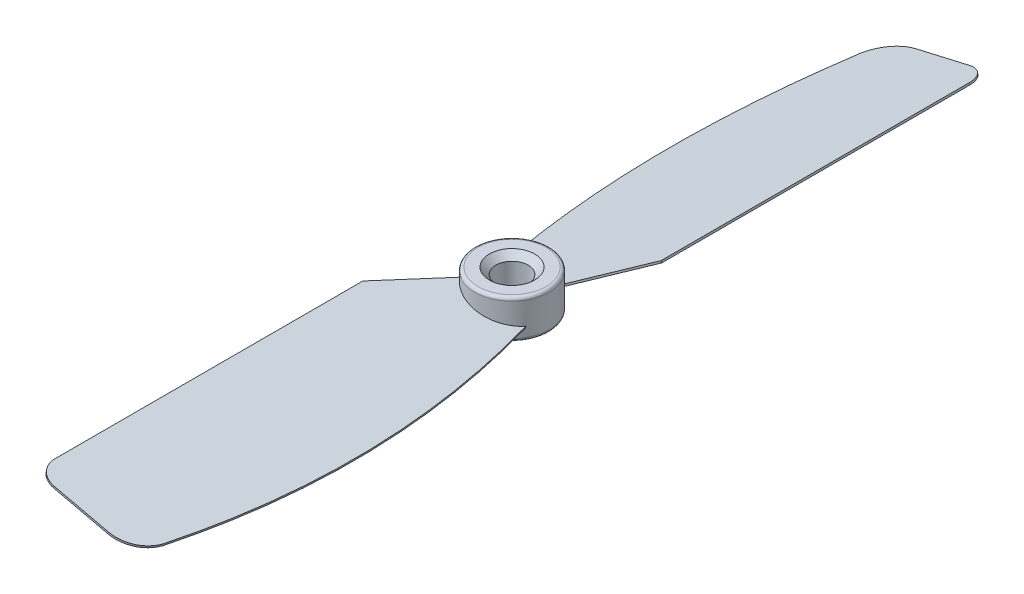
ISO-10303-21;
HEADER;
FILE_DESCRIPTION(('STEP AP214'),'2;1');
FILE_NAME('part.step','',(''),(''),'','','');
FILE_SCHEMA(('AUTOMOTIVE_DESIGN { 1 0 10303 214 1 1 1 1 }'));
ENDSEC;
DATA;
#1=APPLICATION_CONTEXT('core data for automotive mechanical design processes');
#2=APPLICATION_PROTOCOL_DEFINITION('international standard','automotive_design',2000,#1);
#3=PRODUCT_CONTEXT('',#1,'mechanical');
#4=PRODUCT('Part','Part','',(#3));
#5=PRODUCT_RELATED_PRODUCT_CATEGORY('part','',(#4));
#6=PRODUCT_DEFINITION_FORMATION('','',#4);
#7=PRODUCT_DEFINITION_CONTEXT('part definition',#1,'design');
#8=PRODUCT_DEFINITION('design','',#6,#7);
#9=PRODUCT_DEFINITION_SHAPE('','',#8);
#10=(LENGTH_UNIT() NAMED_UNIT(*) SI_UNIT(.MILLI.,.METRE.));
#11=(NAMED_UNIT(*) PLANE_ANGLE_UNIT() SI_UNIT($,.RADIAN.));
#12=(NAMED_UNIT(*) SI_UNIT($,.STERADIAN.) SOLID_ANGLE_UNIT());
#13=UNCERTAINTY_MEASURE_WITH_UNIT(LENGTH_MEASURE(1.E-05),#10,'distance_accuracy_value','');
#14=(GEOMETRIC_REPRESENTATION_CONTEXT(3) GLOBAL_UNCERTAINTY_ASSIGNED_CONTEXT((#13)) GLOBAL_UNIT_ASSIGNED_CONTEXT((#10,
#11,#12)) REPRESENTATION_CONTEXT('',''));
#15=CARTESIAN_POINT('',(0.,0.,0.));
#16=DIRECTION('',(0.,0.,1.));
#17=DIRECTION('',(1.,0.,0.));
#18=AXIS2_PLACEMENT_3D('',#15,#16,#17);
#19=CARTESIAN_POINT('',(0.,3.,0.));
#20=DIRECTION('',(0.,-1.,0.));
#21=DIRECTION('',(0.,0.,-1.));
#22=AXIS2_PLACEMENT_3D('',#19,#20,#21);
#23=CYLINDRICAL_SURFACE('',#22,5.75);
#24=CARTESIAN_POINT('',(0.,-2.5,0.));
#25=DIRECTION('',(0.,1.,0.));
#26=DIRECTION('',(0.,0.,1.));
#27=AXIS2_PLACEMENT_3D('',#24,#25,#26);
#28=CIRCLE('',#27,5.75);
#29=CARTESIAN_POINT('',(0.,-2.5,5.75));
#30=VERTEX_POINT('',#29);
#31=EDGE_CURVE('E412',#30,#30,#28,.T.);
#32=ORIENTED_EDGE('',*,*,#31,.T.);
#33=EDGE_LOOP('',(#32));
#34=FACE_BOUND('',#33,.T.);
#35=CARTESIAN_POINT('',(0.,2.5,0.));
#36=DIRECTION('',(0.,1.,0.));
#37=DIRECTION('',(0.,0.,1.));
#38=AXIS2_PLACEMENT_3D('',#35,#36,#37);
#39=CIRCLE('',#38,5.75);
#40=CARTESIAN_POINT('',(0.,2.5,5.75));
#41=VERTEX_POINT('',#40);
#42=EDGE_CURVE('E417',#41,#41,#39,.F.);
#43=ORIENTED_EDGE('',*,*,#42,.T.);
#44=EDGE_LOOP('',(#43));
#45=FACE_BOUND('',#44,.T.);
#46=CARTESIAN_POINT('',(4.9417821328647,-1.29484591812011,2.93960700626788));
#47=CARTESIAN_POINT('',(4.94963072753522,-1.24621541116266,2.92641441878341));
#48=CARTESIAN_POINT('',(4.95745290419321,-1.19760219934211,2.91314344392264));
#49=CARTESIAN_POINT('',(4.97304442148414,-1.10041036597478,2.88644471944852));
#50=CARTESIAN_POINT('',(4.98081376211709,-1.051831744428,2.87301696983516));
#51=CARTESIAN_POINT('',(4.9885566847375,-1.00327041801812,2.85951083284551));
#52=B_SPLINE_CURVE_WITH_KNOTS('',3,(#46,#47,#48,#49,#50,#51),.UNSPECIFIED.,.F.,.F.,(4,2,4),(0.,
0.152986751924502,0.305973503849005),.UNSPECIFIED.);
#53=CARTESIAN_POINT('',(4.9417821328647,-1.2948459181201,2.93960700626788));
#54=VERTEX_POINT('',#53);
#55=CARTESIAN_POINT('',(4.98855668473749,-1.00327041801825,2.85951083284552));
#56=VERTEX_POINT('',#55);
#57=EDGE_CURVE('E250',#54,#56,#52,.T.);
#58=ORIENTED_EDGE('',*,*,#57,.F.);
#59=CARTESIAN_POINT('',(0.,-0.153945616169008,0.));
#60=DIRECTION('',(-0.224951054343865,-0.974370064785235,0.));
#61=DIRECTION('',(0.974370064785235,-0.224951054343865,0.));
#62=AXIS2_PLACEMENT_3D('',#59,#60,#61);
#63=ELLIPSE('',#62,5.901248619812,5.75);
#64=CARTESIAN_POINT('',(-4.52879961424726,0.891610158742407,3.54294708597149));
#65=VERTEX_POINT('',#64);
#66=EDGE_CURVE('E260',#54,#65,#63,.T.);
#67=ORIENTED_EDGE('',*,*,#66,.T.);
#68=CARTESIAN_POINT('',(0.,10.6574074910067,0.));
#69=DIRECTION('',(-0.82610080536688,0.190720398622423,-0.530267092059743));
#70=DIRECTION('',(-0.160500355097445,-0.981644400762977,-0.103023815034632));
#71=AXIS2_PLACEMENT_3D('',#68,#69,#70);
#72=ELLIPSE('',#71,30.1488463820984,5.75);
#73=CARTESIAN_POINT('',(-4.490682326525,1.19070132181337,3.59113801492452));
#74=VERTEX_POINT('',#73);
#75=EDGE_CURVE('E363',#65,#74,#72,.T.);
#76=ORIENTED_EDGE('',*,*,#75,.T.);
#77=CARTESIAN_POINT('',(0.,0.153945616169009,0.));
#78=DIRECTION('',(-0.224951054343865,-0.974370064785235,0.));
#79=DIRECTION('',(0.974370064785235,-0.224951054343865,0.));
#80=AXIS2_PLACEMENT_3D('',#77,#78,#79);
#81=ELLIPSE('',#80,5.901248619812,5.75);
#82=CARTESIAN_POINT('',(4.18430648262315,-0.812077652589167,3.94386602960455));
#83=VERTEX_POINT('',#82);
#84=EDGE_CURVE('E361',#83,#74,#81,.T.);
#85=ORIENTED_EDGE('',*,*,#84,.F.);
#86=CARTESIAN_POINT('',(3.16767160626644,3.,-4.79878699202761));
#87=CARTESIAN_POINT('',(3.21135823881869,2.86347763932167,-4.76990080416653));
#88=CARTESIAN_POINT('',(3.25831072799962,2.72851525371669,-4.73809518863794));
#89=CARTESIAN_POINT('',(3.35878276436216,2.46270418555435,-4.66743904078927));
#90=CARTESIAN_POINT('',(3.41231267677481,2.33186241493979,-4.62857734168117));
#91=CARTESIAN_POINT('',(3.52582268552945,2.07575808035222,-4.54269725417273));
#92=CARTESIAN_POINT('',(3.58580136458445,1.95049429899198,-4.49568065663974));
#93=CARTESIAN_POINT('',(3.71152105949493,1.70690799351835,-4.39246231239903));
#94=CARTESIAN_POINT('',(3.77725867580308,1.58858144225546,-4.33626596785345));
#95=CARTESIAN_POINT('',(3.91399246351864,1.35883994756971,-4.21327533406064));
#96=CARTESIAN_POINT('',(3.98503443812991,1.24750546292712,-4.14638118579225));
#97=CARTESIAN_POINT('',(4.13002060053663,1.03392989063531,-4.00198562796744));
#98=CARTESIAN_POINT('',(4.20396536707744,0.931690629757777,-3.92448209542118));
#99=CARTESIAN_POINT('',(4.35245136205382,0.737010280755849,-3.75911945986299));
#100=CARTESIAN_POINT('',(4.42699074177325,0.644546351235127,-3.67128555831832));
#101=CARTESIAN_POINT('',(4.57466300030841,0.469127473536056,-3.48554543816858));
#102=CARTESIAN_POINT('',(4.64779597615056,0.386171867415056,-3.38763991737491));
#103=CARTESIAN_POINT('',(4.78298287441558,0.237776232246507,-3.19343798779635));
#104=CARTESIAN_POINT('',(4.8453858444472,0.171411752154987,-3.09808655755151));
#105=CARTESIAN_POINT('',(4.96615503618029,0.0455617023530034,-2.90055208369523));
#106=CARTESIAN_POINT('',(5.02452160039601,-0.0139244513150001,-2.79836962119025));
#107=CARTESIAN_POINT('',(5.13618704477087,-0.12656545453546,-2.5877235693401));
#108=CARTESIAN_POINT('',(5.1894791665124,-0.17971188365455,-2.4792519045131));
#109=CARTESIAN_POINT('',(5.28998148598342,-0.280067198058982,-2.25687567329933));
#110=CARTESIAN_POINT('',(5.33719121185681,-0.327275622682971,-2.14297068634797));
#111=CARTESIAN_POINT('',(5.42836452978435,-0.419870560797796,-1.90090291904142));
#112=CARTESIAN_POINT('',(5.47174064126546,-0.464786888264962,-1.7723384617502));
#113=CARTESIAN_POINT('',(5.54968087363048,-0.548709993894481,-1.51068876801557));
#114=CARTESIAN_POINT('',(5.58424463158523,-0.587716528640298,-1.37760334563585));
#115=CARTESIAN_POINT('',(5.64394293157941,-0.660252373771145,-1.10791552420304));
#116=CARTESIAN_POINT('',(5.66908015778435,-0.693783241791831,-0.971314138163177));
#117=CARTESIAN_POINT('',(5.7094882701705,-0.755758856865341,-0.695473351138391));
#118=CARTESIAN_POINT('',(5.72475563606061,-0.784201786585769,-0.556233027127374));
#119=CARTESIAN_POINT('',(5.74560241971585,-0.837612950445586,-0.268956248094331));
#120=CARTESIAN_POINT('',(5.75064705194649,-0.86232943371669,-0.120833831344237));
#121=CARTESIAN_POINT('',(5.74921977087372,-0.906720010625236,0.176178786841892));
#122=CARTESIAN_POINT('',(5.74274245162587,-0.926391732373468,0.325069315982901));
#123=CARTESIAN_POINT('',(5.71815480587072,-0.960853895575036,0.622471742080835));
#124=CARTESIAN_POINT('',(5.70004323044812,-0.975643812717848,0.770983596669189));
#125=CARTESIAN_POINT('',(5.65221618033073,-1.00042376620019,1.06646198746962));
#126=CARTESIAN_POINT('',(5.62250604404078,-1.01041600602858,1.21342920271255));
#127=CARTESIAN_POINT('',(5.55145844568355,-1.02564659029179,1.50548934051953));
#128=CARTESIAN_POINT('',(5.51006868723436,-1.03086309459926,1.6505706904485));
#129=CARTESIAN_POINT('',(5.41599536510503,-1.03636242242856,1.9370642306828));
#130=CARTESIAN_POINT('',(5.36331588532275,-1.03664702695634,2.07847772710094));
#131=CARTESIAN_POINT('',(5.24698659120449,-1.03206279048437,2.35677664802207));
#132=CARTESIAN_POINT('',(5.18332747467966,-1.0271895615247,2.49365811471466));
#133=CARTESIAN_POINT('',(5.04558750828644,-1.0119058020542,2.76174846056919));
#134=CARTESIAN_POINT('',(4.97150719016936,-1.00149555399949,2.89295762871903));
#135=CARTESIAN_POINT('',(4.81482569395801,-0.97476777038085,3.14671903456508));
#136=CARTESIAN_POINT('',(4.73237554141263,-0.958544963332007,3.26937441961475));
#137=CARTESIAN_POINT('',(4.55885183353354,-0.919359902426758,3.50728359663349));
#138=CARTESIAN_POINT('',(4.46777922987299,-0.896398391745371,3.62253820308679));
#139=CARTESIAN_POINT('',(4.2782008492359,-0.842610427821037,3.84457854183849));
#140=CARTESIAN_POINT('',(4.17970394427395,-0.811793260322456,3.95137407912479));
#141=CARTESIAN_POINT('',(3.97667295590769,-0.740684653806231,4.15563004786195));
#142=CARTESIAN_POINT('',(3.87214267728593,-0.700399137545731,4.2530962616863));
#143=CARTESIAN_POINT('',(3.70067032253633,-0.626175848791668,4.40169944136899));
#144=CARTESIAN_POINT('',(3.63495093630015,-0.595880199382195,4.45609166326384));
#145=CARTESIAN_POINT('',(3.50271116087788,-0.530373645404925,4.5607691980547));
#146=CARTESIAN_POINT('',(3.43619104019514,-0.495164348722405,4.6110558459137));
#147=CARTESIAN_POINT('',(3.3032630931747,-0.419268685131995,4.70719281051927));
#148=CARTESIAN_POINT('',(3.23685528166762,-0.378592353905034,4.75305099746902));
#149=CARTESIAN_POINT('',(3.10506551106653,-0.291164460654061,4.8401778986794));
#150=CARTESIAN_POINT('',(3.03968338231666,-0.244413915484126,4.88144737897154));
#151=CARTESIAN_POINT('',(2.86605785764219,-0.109258322094918,4.98642514684996));
#152=CARTESIAN_POINT('',(2.7598125208222,-0.0145851517664133,5.04564491025323));
#153=CARTESIAN_POINT('',(2.56014858894786,0.193726514284796,5.1498449450528));
#154=CARTESIAN_POINT('',(2.46670376400153,0.307325137016162,5.19485458960251));
#155=CARTESIAN_POINT('',(2.29716490186737,0.549551252564028,5.27202434677673));
#156=CARTESIAN_POINT('',(2.22097432448156,0.678088711318857,5.3042567520434));
#157=CARTESIAN_POINT('',(2.11930159246336,0.879102028300293,5.34531430199157));
#158=CARTESIAN_POINT('',(2.08741443388145,0.947755641417451,5.35781897765336));
#159=CARTESIAN_POINT('',(2.02769130852339,1.08714496751949,5.3807053500982));
#160=CARTESIAN_POINT('',(1.99985497879419,1.15788049328201,5.39108723711629));
#161=CARTESIAN_POINT('',(1.92204804698519,1.37218880627227,5.41953166652336));
#162=CARTESIAN_POINT('',(1.8776460898563,1.51813612836278,5.43494502822963));
#163=CARTESIAN_POINT('',(1.80065963086418,1.81370800548155,5.46092881835123));
#164=CARTESIAN_POINT('',(1.76810074726821,1.96333979331345,5.47148876096717));
#165=CARTESIAN_POINT('',(1.71286660847994,2.26070780674924,5.48902524305081));
#166=CARTESIAN_POINT('',(1.68996510914258,2.40839823738088,5.49608458360291));
#167=CARTESIAN_POINT('',(1.6607340621867,2.6302730938577,5.50495772524652));
#168=CARTESIAN_POINT('',(1.65185932036268,2.70410804427553,5.50762504304568));
#169=CARTESIAN_POINT('',(1.63559702588113,2.85194037529872,5.51247617155887));
#170=CARTESIAN_POINT('',(1.62820912076886,2.92593771319571,5.5146600968734));
#171=CARTESIAN_POINT('',(1.6214686491818,2.99999999996983,5.51664204201438));
#172=B_SPLINE_CURVE_WITH_KNOTS('',3,(#86,#87,#88,#89,#90,#91,#92,#93,#94,#95,#96,#97,#98,#99,
#100,#101,#102,#103,#104,#105,#106,#107,#108,#109,#110,#111,#112,#113,#114,#115,#116,#117,#118,
#119,#120,#121,#122,#123,#124,#125,#126,#127,#128,#129,#130,#131,#132,#133,#134,#135,#136,#137,
#138,#139,#140,#141,#142,#143,#144,#145,#146,#147,#148,#149,#150,#151,#152,#153,#154,#155,#156,
#157,#158,#159,#160,#161,#162,#163,#164,#165,#166,#167,#168,#169,#170,#171),.UNSPECIFIED.,.F.,
.F.,(4,2,2,2,2,2,2,2,2,2,2,2,2,2,2,2,2,2,2,2,2,2,2,2,2,2,2,2,2,2,2,2,2,2,2,2,2,2,2,2,2,2,4),(0.,
0.43874216926316,0.878184831150759,1.31753111055053,1.7566197656927,2.20007610467262,
2.64362131151342,3.086106075379,3.52856020234178,3.92375798613212,4.31892219366864,
4.71460554898124,5.11031958189865,5.53862093954271,5.96693993355944,6.39513687275773,
6.82348645316722,7.27371955937333,7.72416396460999,8.17465673228089,8.62494239815624,
9.07727714625673,9.52944854398299,9.9820049300964,10.434538232478,10.8800090097613,
11.3254306769423,11.7703282573157,12.2149482771483,12.4863383067682,12.7576397371736,
13.028449781144,13.2992145484171,13.7593125354183,14.2184531497409,14.6749575788319,
14.904994111258,15.1350100197731,15.5941238149781,16.0542249147554,16.5028511936243,
16.726081778648,16.9492593843557),.UNSPECIFIED.);
#173=EDGE_CURVE('E274',#56,#83,#172,.T.);
#174=ORIENTED_EDGE('',*,*,#173,.F.);
#175=EDGE_LOOP('',(#58,#67,#76,#85,#174));
#176=FACE_BOUND('',#175,.T.);
#177=CARTESIAN_POINT('',(-4.9417821328647,-1.29484591812011,-2.93960700626788));
#178=CARTESIAN_POINT('',(-4.94963072753522,-1.24621541116266,-2.92641441878341));
#179=CARTESIAN_POINT('',(-4.95745290419321,-1.19760219934211,-2.91314344392264));
#180=CARTESIAN_POINT('',(-4.97304442148414,-1.10041036597478,-2.88644471944852));
#181=CARTESIAN_POINT('',(-4.98081376211709,-1.051831744428,-2.87301696983516));
#182=CARTESIAN_POINT('',(-4.9885566847375,-1.00327041801812,-2.85951083284551));
#183=B_SPLINE_CURVE_WITH_KNOTS('',3,(#177,#178,#179,#180,#181,#182),.UNSPECIFIED.,.F.,.F.,(4,2,
4),(0.,0.152986751924502,0.305973503849005),.UNSPECIFIED.);
#184=CARTESIAN_POINT('',(-4.9417821328647,-1.2948459181201,-2.93960700626788));
#185=VERTEX_POINT('',#184);
#186=CARTESIAN_POINT('',(-4.98855668473749,-1.00327041801825,-2.85951083284552));
#187=VERTEX_POINT('',#186);
#188=EDGE_CURVE('E60',#185,#187,#183,.T.);
#189=ORIENTED_EDGE('',*,*,#188,.F.);
#190=CARTESIAN_POINT('',(0.,-0.153945616169008,0.));
#191=DIRECTION('',(0.224951054343865,-0.974370064785235,0.));
#192=DIRECTION('',(-0.974370064785235,-0.224951054343865,0.));
#193=AXIS2_PLACEMENT_3D('',#190,#191,#192);
#194=ELLIPSE('',#193,5.901248619812,5.75);
#195=CARTESIAN_POINT('',(4.52879961424726,0.891610158742407,-3.54294708597149));
#196=VERTEX_POINT('',#195);
#197=EDGE_CURVE('E163',#185,#196,#194,.T.);
#198=ORIENTED_EDGE('',*,*,#197,.T.);
#199=CARTESIAN_POINT('',(0.,10.6574074910067,0.));
#200=DIRECTION('',(0.82610080536688,0.190720398622423,0.530267092059743));
#201=DIRECTION('',(0.160500355097445,-0.981644400762977,0.103023815034632));
#202=AXIS2_PLACEMENT_3D('',#199,#200,#201);
#203=ELLIPSE('',#202,30.1488463820984,5.75);
#204=CARTESIAN_POINT('',(4.490682326525,1.19070132181337,-3.59113801492452));
#205=VERTEX_POINT('',#204);
#206=EDGE_CURVE('E289',#196,#205,#203,.T.);
#207=ORIENTED_EDGE('',*,*,#206,.T.);
#208=CARTESIAN_POINT('',(0.,0.153945616169009,0.));
#209=DIRECTION('',(0.224951054343865,-0.974370064785235,0.));
#210=DIRECTION('',(-0.974370064785235,-0.224951054343865,0.));
#211=AXIS2_PLACEMENT_3D('',#208,#209,#210);
#212=ELLIPSE('',#211,5.901248619812,5.75);
#213=CARTESIAN_POINT('',(-4.18430648262315,-0.812077652589167,-3.94386602960455));
#214=VERTEX_POINT('',#213);
#215=EDGE_CURVE('E259',#214,#205,#212,.T.);
#216=ORIENTED_EDGE('',*,*,#215,.F.);
#217=CARTESIAN_POINT('',(-3.16767160626644,3.,4.79878699202761));
#218=CARTESIAN_POINT('',(-3.21135823881869,2.86347763932167,4.76990080416653));
#219=CARTESIAN_POINT('',(-3.25831072799962,2.72851525371669,4.73809518863794));
#220=CARTESIAN_POINT('',(-3.35878276436216,2.46270418555435,4.66743904078927));
#221=CARTESIAN_POINT('',(-3.41231267677481,2.33186241493979,4.62857734168117));
#222=CARTESIAN_POINT('',(-3.52582268552945,2.07575808035222,4.54269725417273));
#223=CARTESIAN_POINT('',(-3.58580136458445,1.95049429899198,4.49568065663974));
#224=CARTESIAN_POINT('',(-3.71152105949493,1.70690799351835,4.39246231239903));
#225=CARTESIAN_POINT('',(-3.77725867580308,1.58858144225546,4.33626596785345));
#226=CARTESIAN_POINT('',(-3.91399246351864,1.35883994756971,4.21327533406064));
#227=CARTESIAN_POINT('',(-3.98503443812991,1.24750546292712,4.14638118579225));
#228=CARTESIAN_POINT('',(-4.13002060053663,1.03392989063531,4.00198562796744));
#229=CARTESIAN_POINT('',(-4.20396536707744,0.931690629757777,3.92448209542118));
#230=CARTESIAN_POINT('',(-4.35245136205382,0.737010280755849,3.75911945986299));
#231=CARTESIAN_POINT('',(-4.42699074177325,0.644546351235127,3.67128555831832));
#232=CARTESIAN_POINT('',(-4.57466300030841,0.469127473536056,3.48554543816858));
#233=CARTESIAN_POINT('',(-4.64779597615056,0.386171867415056,3.38763991737491));
#234=CARTESIAN_POINT('',(-4.78298287441558,0.237776232246507,3.19343798779635));
#235=CARTESIAN_POINT('',(-4.8453858444472,0.171411752154987,3.09808655755151));
#236=CARTESIAN_POINT('',(-4.96615503618029,0.0455617023530034,2.90055208369523));
#237=CARTESIAN_POINT('',(-5.02452160039601,-0.0139244513150001,2.79836962119025));
#238=CARTESIAN_POINT('',(-5.13618704477087,-0.12656545453546,2.5877235693401));
#239=CARTESIAN_POINT('',(-5.1894791665124,-0.17971188365455,2.4792519045131));
#240=CARTESIAN_POINT('',(-5.28998148598342,-0.280067198058982,2.25687567329933));
#241=CARTESIAN_POINT('',(-5.33719121185681,-0.327275622682971,2.14297068634797));
#242=CARTESIAN_POINT('',(-5.42836452978435,-0.419870560797796,1.90090291904142));
#243=CARTESIAN_POINT('',(-5.47174064126546,-0.464786888264962,1.7723384617502));
#244=CARTESIAN_POINT('',(-5.54968087363048,-0.548709993894481,1.51068876801557));
#245=CARTESIAN_POINT('',(-5.58424463158523,-0.587716528640297,1.37760334563585));
#246=CARTESIAN_POINT('',(-5.64394293157941,-0.660252373771146,1.10791552420304));
#247=CARTESIAN_POINT('',(-5.66908015778435,-0.693783241791835,0.971314138163178));
#248=CARTESIAN_POINT('',(-5.7094882701705,-0.755758856865344,0.695473351138392));
#249=CARTESIAN_POINT('',(-5.72475563606061,-0.78420178658577,0.556233027127374));
#250=CARTESIAN_POINT('',(-5.74560241971585,-0.837612950445585,0.268956248094331));
#251=CARTESIAN_POINT('',(-5.75064705194649,-0.862329433716692,0.120833831344238));
#252=CARTESIAN_POINT('',(-5.74921977087372,-0.906720010625238,-0.176178786841891));
#253=CARTESIAN_POINT('',(-5.74274245162587,-0.926391732373469,-0.325069315982901));
#254=CARTESIAN_POINT('',(-5.71815480587072,-0.960853895575036,-0.622471742080835));
#255=CARTESIAN_POINT('',(-5.70004323044812,-0.975643812717849,-0.770983596669189));
#256=CARTESIAN_POINT('',(-5.65221618033073,-1.00042376620019,-1.06646198746963));
#257=CARTESIAN_POINT('',(-5.62250604404078,-1.01041600602858,-1.21342920271255));
#258=CARTESIAN_POINT('',(-5.55145844568355,-1.02564659029179,-1.50548934051953));
#259=CARTESIAN_POINT('',(-5.51006868723436,-1.03086309459926,-1.6505706904485));
#260=CARTESIAN_POINT('',(-5.41599536510503,-1.03636242242856,-1.9370642306828));
#261=CARTESIAN_POINT('',(-5.36331588532275,-1.03664702695634,-2.07847772710094));
#262=CARTESIAN_POINT('',(-5.24698659120449,-1.03206279048437,-2.35677664802207));
#263=CARTESIAN_POINT('',(-5.18332747467966,-1.0271895615247,-2.49365811471466));
#264=CARTESIAN_POINT('',(-5.04558750828644,-1.0119058020542,-2.76174846056919));
#265=CARTESIAN_POINT('',(-4.97150719016936,-1.00149555399949,-2.89295762871903));
#266=CARTESIAN_POINT('',(-4.81482569395801,-0.97476777038085,-3.14671903456508));
#267=CARTESIAN_POINT('',(-4.73237554141263,-0.958544963332007,-3.26937441961475));
#268=CARTESIAN_POINT('',(-4.55885183353354,-0.919359902426758,-3.50728359663349));
#269=CARTESIAN_POINT('',(-4.46777922987299,-0.896398391745371,-3.62253820308679));
#270=CARTESIAN_POINT('',(-4.2782008492359,-0.842610427821037,-3.84457854183849));
#271=CARTESIAN_POINT('',(-4.17970394427395,-0.811793260322456,-3.95137407912479));
#272=CARTESIAN_POINT('',(-3.97667295590769,-0.740684653806231,-4.15563004786195));
#273=CARTESIAN_POINT('',(-3.87214267728593,-0.700399137545731,-4.2530962616863));
#274=CARTESIAN_POINT('',(-3.70067032253633,-0.626175848791668,-4.40169944136899));
#275=CARTESIAN_POINT('',(-3.63495093630015,-0.595880199382195,-4.45609166326384));
#276=CARTESIAN_POINT('',(-3.50271116087788,-0.530373645404925,-4.5607691980547));
#277=CARTESIAN_POINT('',(-3.43619104019514,-0.495164348722405,-4.6110558459137));
#278=CARTESIAN_POINT('',(-3.3032630931747,-0.419268685131995,-4.70719281051927));
#279=CARTESIAN_POINT('',(-3.23685528166762,-0.378592353905034,-4.75305099746902));
#280=CARTESIAN_POINT('',(-3.10506551106653,-0.291164460654061,-4.8401778986794));
#281=CARTESIAN_POINT('',(-3.03968338231666,-0.244413915484126,-4.88144737897154));
#282=CARTESIAN_POINT('',(-2.86605785764219,-0.109258322094918,-4.98642514684996));
#283=CARTESIAN_POINT('',(-2.7598125208222,-0.0145851517664133,-5.04564491025323));
#284=CARTESIAN_POINT('',(-2.56014858894786,0.193726514284796,-5.1498449450528));
#285=CARTESIAN_POINT('',(-2.46670376400153,0.307325137016162,-5.19485458960251));
#286=CARTESIAN_POINT('',(-2.29716490186737,0.549551252564028,-5.27202434677673));
#287=CARTESIAN_POINT('',(-2.22097432448156,0.678088711318857,-5.3042567520434));
#288=CARTESIAN_POINT('',(-2.11930159246336,0.879102028300293,-5.34531430199157));
#289=CARTESIAN_POINT('',(-2.08741443388145,0.947755641417451,-5.35781897765336));
#290=CARTESIAN_POINT('',(-2.02769130852339,1.08714496751949,-5.3807053500982));
#291=CARTESIAN_POINT('',(-1.99985497879419,1.15788049328201,-5.39108723711629));
#292=CARTESIAN_POINT('',(-1.92204804698519,1.37218880627227,-5.41953166652336));
#293=CARTESIAN_POINT('',(-1.8776460898563,1.51813612836278,-5.43494502822963));
#294=CARTESIAN_POINT('',(-1.80065963086418,1.81370800548155,-5.46092881835123));
#295=CARTESIAN_POINT('',(-1.7681007472682,1.96333979331344,-5.47148876096717));
#296=CARTESIAN_POINT('',(-1.71286660847994,2.26070780674924,-5.48902524305081));
#297=CARTESIAN_POINT('',(-1.68996510914259,2.40839823738088,-5.49608458360291));
#298=CARTESIAN_POINT('',(-1.6607340621867,2.6302730938577,-5.50495772524652));
#299=CARTESIAN_POINT('',(-1.65185932036268,2.70410804427553,-5.50762504304568));
#300=CARTESIAN_POINT('',(-1.63559702588112,2.85194037529872,-5.51247617155887));
#301=CARTESIAN_POINT('',(-1.62820912076886,2.92593771319571,-5.5146600968734));
#302=CARTESIAN_POINT('',(-1.6214686491818,2.99999999996983,-5.51664204201438));
#303=B_SPLINE_CURVE_WITH_KNOTS('',3,(#217,#218,#219,#220,#221,#222,#223,#224,#225,#226,#227,
#228,#229,#230,#231,#232,#233,#234,#235,#236,#237,#238,#239,#240,#241,#242,#243,#244,#245,#246,
#247,#248,#249,#250,#251,#252,#253,#254,#255,#256,#257,#258,#259,#260,#261,#262,#263,#264,#265,
#266,#267,#268,#269,#270,#271,#272,#273,#274,#275,#276,#277,#278,#279,#280,#281,#282,#283,#284,
#285,#286,#287,#288,#289,#290,#291,#292,#293,#294,#295,#296,#297,#298,#299,#300,#301,#302),
.UNSPECIFIED.,.F.,.F.,(4,2,2,2,2,2,2,2,2,2,2,2,2,2,2,2,2,2,2,2,2,2,2,2,2,2,2,2,2,2,2,2,2,2,2,2,
2,2,2,2,2,2,4),(0.,0.43874216926316,0.878184831150759,1.31753111055053,1.7566197656927,
2.20007610467262,2.64362131151342,3.086106075379,3.52856020234178,3.92375798613212,
4.31892219366864,4.71460554898124,5.11031958189865,5.53862093954271,5.96693993355944,
6.39513687275774,6.82348645316722,7.27371955937333,7.72416396460999,8.17465673228089,
8.62494239815624,9.07727714625673,9.52944854398299,9.9820049300964,10.434538232478,
10.8800090097614,11.3254306769423,11.7703282573157,12.2149482771483,12.4863383067682,
12.7576397371736,13.028449781144,13.2992145484171,13.7593125354183,14.2184531497409,
14.6749575788319,14.904994111258,15.1350100197731,15.5941238149781,16.0542249147554,
16.5028511936243,16.726081778648,16.9492593843557),.UNSPECIFIED.);
#304=EDGE_CURVE('E65',#187,#214,#303,.T.);
#305=ORIENTED_EDGE('',*,*,#304,.F.);
#306=EDGE_LOOP('',(#189,#198,#207,#216,#305));
#307=FACE_BOUND('',#306,.T.);
#308=ADVANCED_FACE('F44',(#34,#45,#176,#307),#23,.T.);
#309=CARTESIAN_POINT('',(0.,3.,0.));
#310=DIRECTION('',(0.,1.,0.));
#311=DIRECTION('',(0.,0.,1.));
#312=AXIS2_PLACEMENT_3D('',#309,#310,#311);
#313=PLANE('',#312);
#314=CARTESIAN_POINT('',(0.,3.,0.));
#315=DIRECTION('',(0.,1.,0.));
#316=DIRECTION('',(0.,0.,1.));
#317=AXIS2_PLACEMENT_3D('',#314,#315,#316);
#318=CIRCLE('',#317,3.5);
#319=CARTESIAN_POINT('',(0.,3.,3.5));
#320=VERTEX_POINT('',#319);
#321=EDGE_CURVE('E13',#320,#320,#318,.F.);
#322=ORIENTED_EDGE('',*,*,#321,.T.);
#323=EDGE_LOOP('',(#322));
#324=FACE_BOUND('',#323,.T.);
#325=CARTESIAN_POINT('',(0.,3.,0.));
#326=DIRECTION('',(0.,1.,0.));
#327=DIRECTION('',(0.,0.,1.));
#328=AXIS2_PLACEMENT_3D('',#325,#326,#327);
#329=CIRCLE('',#328,5.25);
#330=CARTESIAN_POINT('',(0.,3.,5.25));
#331=VERTEX_POINT('',#330);
#332=EDGE_CURVE('E411',#331,#331,#329,.T.);
#333=ORIENTED_EDGE('',*,*,#332,.T.);
#334=EDGE_LOOP('',(#333));
#335=FACE_BOUND('',#334,.T.);
#336=ADVANCED_FACE('F267',(#324,#335),#313,.T.);
#337=CARTESIAN_POINT('',(0.,-3.,0.));
#338=DIRECTION('',(0.,1.,0.));
#339=DIRECTION('',(0.,0.,1.));
#340=AXIS2_PLACEMENT_3D('',#337,#338,#339);
#341=PLANE('',#340);
#342=CARTESIAN_POINT('',(0.,-3.,0.));
#343=DIRECTION('',(0.,1.,0.));
#344=DIRECTION('',(0.,0.,1.));
#345=AXIS2_PLACEMENT_3D('',#342,#343,#344);
#346=CIRCLE('',#345,3.5);
#347=CARTESIAN_POINT('',(0.,-3.,3.5));
#348=VERTEX_POINT('',#347);
#349=EDGE_CURVE('E406',#348,#348,#346,.T.);
#350=ORIENTED_EDGE('',*,*,#349,.T.);
#351=EDGE_LOOP('',(#350));
#352=FACE_BOUND('',#351,.T.);
#353=CARTESIAN_POINT('',(0.,-3.,0.));
#354=DIRECTION('',(0.,1.,0.));
#355=DIRECTION('',(0.,0.,1.));
#356=AXIS2_PLACEMENT_3D('',#353,#354,#355);
#357=CIRCLE('',#356,5.25);
#358=CARTESIAN_POINT('',(0.,-3.,5.25));
#359=VERTEX_POINT('',#358);
#360=EDGE_CURVE('E409',#359,#359,#357,.F.);
#361=ORIENTED_EDGE('',*,*,#360,.T.);
#362=EDGE_LOOP('',(#361));
#363=FACE_BOUND('',#362,.T.);
#364=ADVANCED_FACE('F269',(#352,#363),#341,.F.);
#365=CARTESIAN_POINT('',(0.40498690286177,-0.24744420986225,0.182487628069947));
#366=DIRECTION('',(0.224951054343865,0.974370064785235,0.));
#367=DIRECTION('',(-0.974370064785235,0.224951054343865,0.));
#368=AXIS2_PLACEMENT_3D('',#365,#366,#367);
#369=CYLINDRICAL_SURFACE('',#368,5.353506784355);
#370=DIRECTION('',(0.224951054343865,0.974370064785235,0.));
#371=VECTOR('',#370,1.);
#372=CARTESIAN_POINT('',(4.92228060999424,-1.29034363681082,2.85951083284551));
#373=LINE('',#372,#371);
#374=CARTESIAN_POINT('',(4.9897659262974,-0.998032617375246,2.85951083284551));
#375=VERTEX_POINT('',#374);
#376=EDGE_CURVE('E359',#56,#375,#373,.T.);
#377=ORIENTED_EDGE('',*,*,#376,.F.);
#378=ORIENTED_EDGE('',*,*,#173,.T.);
#379=CARTESIAN_POINT('',(0.47247221916493,0.0448668095733206,0.182487628069947));
#380=DIRECTION('',(-0.224951054343865,-0.974370064785235,0.));
#381=DIRECTION('',(0.974370064785235,-0.224951054343865,0.));
#382=AXIS2_PLACEMENT_3D('',#379,#380,#381);
#383=CIRCLE('',#382,5.353506784355);
#384=EDGE_CURVE('E225',#83,#375,#383,.F.);
#385=ORIENTED_EDGE('',*,*,#384,.T.);
#386=EDGE_LOOP('',(#377,#378,#385));
#387=FACE_BOUND('',#386,.T.);
#388=ADVANCED_FACE('F244',(#387),#369,.F.);
#389=CARTESIAN_POINT('',(4.92228060999424,-1.29034363681081,2.85951083284551));
#390=CARTESIAN_POINT('',(11.6898550258061,-2.85276130049693,30.6174631907921));
#391=CARTESIAN_POINT('',(5.93526306039396,-1.52420906277653,59.1543290893312));
#392=B_SPLINE_CURVE_WITH_KNOTS('',2,(#389,#390,#391),.UNSPECIFIED.,.F.,.F.,(3,3),(0.,1.),.UNSPECIFIED.);
#393=DIRECTION('',(0.224951054343865,0.974370064785235,0.));
#394=VECTOR('',#393,1.);
#395=SURFACE_OF_LINEAR_EXTRUSION('',#392,#394);
#396=CARTESIAN_POINT('',(5.93526306039396,-1.52420906277654,59.1543290893312));
#397=VERTEX_POINT('',#396);
#398=EDGE_CURVE('E226',#54,#397,#392,.T.);
#399=ORIENTED_EDGE('',*,*,#398,.F.);
#400=ORIENTED_EDGE('',*,*,#57,.T.);
#401=ORIENTED_EDGE('',*,*,#376,.T.);
#402=CARTESIAN_POINT('',(4.9897659262974,-0.998032617375236,2.85951083284551));
#403=CARTESIAN_POINT('',(11.7573403421093,-2.56045028106136,30.6174631907921));
#404=CARTESIAN_POINT('',(6.00274837669712,-1.23189804334096,59.1543290893312));
#405=B_SPLINE_CURVE_WITH_KNOTS('',2,(#402,#403,#404),.UNSPECIFIED.,.F.,.F.,(3,3),(0.,1.),.UNSPECIFIED.);
#406=CARTESIAN_POINT('',(6.00274837669712,-1.23189804334097,59.1543290893312));
#407=VERTEX_POINT('',#406);
#408=EDGE_CURVE('E385',#375,#407,#405,.T.);
#409=ORIENTED_EDGE('',*,*,#408,.T.);
#410=DIRECTION('',(0.224951054343865,0.974370064785235,0.));
#411=VECTOR('',#410,1.);
#412=CARTESIAN_POINT('',(5.93526306039396,-1.52420906277654,59.1543290893312));
#413=LINE('',#412,#411);
#414=EDGE_CURVE('E356',#397,#407,#413,.T.);
#415=ORIENTED_EDGE('',*,*,#414,.F.);
#416=EDGE_LOOP('',(#399,#400,#401,#409,#415));
#417=FACE_BOUND('',#416,.T.);
#418=ADVANCED_FACE('F238',(#417),#395,.F.);
#419=CARTESIAN_POINT('',(1.10531021259986,-0.40912658558455,58.5));
#420=DIRECTION('',(0.224951054343865,0.974370064785235,0.));
#421=DIRECTION('',(-0.974370064785235,0.224951054343865,0.));
#422=AXIS2_PLACEMENT_3D('',#419,#420,#421);
#423=CYLINDRICAL_SURFACE('',#422,5.);
#424=CARTESIAN_POINT('',(1.17279552890302,-0.11681556614898,58.5));
#425=DIRECTION('',(-0.224951054343865,-0.974370064785235,0.));
#426=DIRECTION('',(0.974370064785235,-0.224951054343865,0.));
#427=AXIS2_PLACEMENT_3D('',#424,#425,#426);
#428=CIRCLE('',#427,5.);
#429=CARTESIAN_POINT('',(1.17279552890302,-0.116815566148978,63.5));
#430=VERTEX_POINT('',#429);
#431=EDGE_CURVE('E336',#407,#430,#428,.T.);
#432=ORIENTED_EDGE('',*,*,#431,.T.);
#433=DIRECTION('',(0.224951054343865,0.974370064785235,0.));
#434=VECTOR('',#433,1.);
#435=CARTESIAN_POINT('',(1.10531021259986,-0.409126585584549,63.5));
#436=LINE('',#435,#434);
#437=CARTESIAN_POINT('',(1.10531021259986,-0.409126585584549,63.5));
#438=VERTEX_POINT('',#437);
#439=EDGE_CURVE('E332',#438,#430,#436,.T.);
#440=ORIENTED_EDGE('',*,*,#439,.F.);
#441=CARTESIAN_POINT('',(1.10531021259986,-0.40912658558455,58.5));
#442=DIRECTION('',(-0.224951054343865,-0.974370064785235,0.));
#443=DIRECTION('',(0.974370064785235,-0.224951054343865,0.));
#444=AXIS2_PLACEMENT_3D('',#441,#442,#443);
#445=CIRCLE('',#444,5.);
#446=EDGE_CURVE('E231',#397,#438,#445,.T.);
#447=ORIENTED_EDGE('',*,*,#446,.F.);
#448=ORIENTED_EDGE('',*,*,#414,.T.);
#449=EDGE_LOOP('',(#432,#440,#447,#448));
#450=FACE_BOUND('',#449,.T.);
#451=ADVANCED_FACE('F243',(#450),#423,.T.);
#452=CARTESIAN_POINT('',(-0.0337426581515799,-0.146155509717786,63.5));
#453=DIRECTION('',(0.,0.,1.));
#454=DIRECTION('',(1.,0.,0.));
#455=AXIS2_PLACEMENT_3D('',#452,#453,#454);
#456=PLANE('',#455);
#457=DIRECTION('',(0.974370064785235,-0.224951054343865,0.));
#458=VECTOR('',#457,1.);
#459=CARTESIAN_POINT('',(0.0337426581515797,0.146155509717785,63.5));
#460=LINE('',#459,#458);
#461=CARTESIAN_POINT('',(-7.23203705251577,1.82359292863638,63.5));
#462=VERTEX_POINT('',#461);
#463=EDGE_CURVE('E326',#462,#430,#460,.T.);
#464=ORIENTED_EDGE('',*,*,#463,.F.);
#465=DIRECTION('',(0.224951054343865,0.974370064785235,0.));
#466=VECTOR('',#465,1.);
#467=CARTESIAN_POINT('',(-7.29952236881893,1.53128190920081,63.5));
#468=LINE('',#467,#466);
#469=CARTESIAN_POINT('',(-7.29952236881893,1.53128190920081,63.5));
#470=VERTEX_POINT('',#469);
#471=EDGE_CURVE('E329',#470,#462,#468,.T.);
#472=ORIENTED_EDGE('',*,*,#471,.F.);
#473=DIRECTION('',(0.974370064785235,-0.224951054343865,0.));
#474=VECTOR('',#473,1.);
#475=CARTESIAN_POINT('',(-0.0337426581515799,-0.146155509717786,63.5));
#476=LINE('',#475,#474);
#477=EDGE_CURVE('E669',#470,#438,#476,.T.);
#478=ORIENTED_EDGE('',*,*,#477,.T.);
#479=ORIENTED_EDGE('',*,*,#439,.T.);
#480=EDGE_LOOP('',(#464,#472,#478,#479));
#481=FACE_BOUND('',#480,.T.);
#482=ADVANCED_FACE('F316',(#481),#456,.T.);
#483=CARTESIAN_POINT('',(-7.29952236881896,1.53128190920081,60.5));
#484=DIRECTION('',(0.224951054343865,0.974370064785235,0.));
#485=DIRECTION('',(-0.974370064785235,0.224951054343865,0.));
#486=AXIS2_PLACEMENT_3D('',#483,#484,#485);
#487=CYLINDRICAL_SURFACE('',#486,3.);
#488=CARTESIAN_POINT('',(-7.2320370525158,1.82359292863638,60.5));
#489=DIRECTION('',(-0.224951054343865,-0.974370064785235,0.));
#490=DIRECTION('',(0.974370064785235,-0.224951054343865,0.));
#491=AXIS2_PLACEMENT_3D('',#488,#489,#490);
#492=CIRCLE('',#491,3.);
#493=CARTESIAN_POINT('',(-10.1551472468715,2.49844609166798,60.5));
#494=VERTEX_POINT('',#493);
#495=EDGE_CURVE('E335',#494,#462,#492,.F.);
#496=ORIENTED_EDGE('',*,*,#495,.F.);
#497=DIRECTION('',(0.224951054343865,0.974370064785235,0.));
#498=VECTOR('',#497,1.);
#499=CARTESIAN_POINT('',(-10.2226325631747,2.20613507223241,60.5));
#500=LINE('',#499,#498);
#501=CARTESIAN_POINT('',(-10.2226325631747,2.20613507223241,60.5));
#502=VERTEX_POINT('',#501);
#503=EDGE_CURVE('E351',#502,#494,#500,.T.);
#504=ORIENTED_EDGE('',*,*,#503,.F.);
#505=CARTESIAN_POINT('',(-7.29952236881896,1.53128190920081,60.5));
#506=DIRECTION('',(-0.224951054343865,-0.974370064785235,0.));
#507=DIRECTION('',(0.974370064785235,-0.224951054343865,0.));
#508=AXIS2_PLACEMENT_3D('',#505,#506,#507);
#509=CIRCLE('',#508,3.);
#510=EDGE_CURVE('E380',#502,#470,#509,.F.);
#511=ORIENTED_EDGE('',*,*,#510,.T.);
#512=ORIENTED_EDGE('',*,*,#471,.T.);
#513=EDGE_LOOP('',(#496,#504,#511,#512));
#514=FACE_BOUND('',#513,.T.);
#515=ADVANCED_FACE('F313',(#514),#487,.T.);
#516=CARTESIAN_POINT('',(-10.2226325631747,2.20613507223241,0.));
#517=DIRECTION('',(-0.974370064785235,0.224951054343865,0.));
#518=DIRECTION('',(-0.224951054343865,-0.974370064785235,0.));
#519=AXIS2_PLACEMENT_3D('',#516,#517,#518);
#520=PLANE('',#519);
#521=DIRECTION('',(0.,0.,1.));
#522=VECTOR('',#521,1.);
#523=CARTESIAN_POINT('',(-10.1551472468715,2.49844609166798,0.));
#524=LINE('',#523,#522);
#525=CARTESIAN_POINT('',(-10.1551472468715,2.49844609166798,12.8861380446801));
#526=VERTEX_POINT('',#525);
#527=EDGE_CURVE('E342',#526,#494,#524,.T.);
#528=ORIENTED_EDGE('',*,*,#527,.F.);
#529=DIRECTION('',(0.224951054343865,0.974370064785235,0.));
#530=VECTOR('',#529,1.);
#531=CARTESIAN_POINT('',(-10.2226325631747,2.20613507223241,12.8861380446801));
#532=LINE('',#531,#530);
#533=CARTESIAN_POINT('',(-10.2226325631747,2.20613507223241,12.8861380446801));
#534=VERTEX_POINT('',#533);
#535=EDGE_CURVE('E348',#534,#526,#532,.T.);
#536=ORIENTED_EDGE('',*,*,#535,.F.);
#537=DIRECTION('',(0.,0.,1.));
#538=VECTOR('',#537,1.);
#539=CARTESIAN_POINT('',(-10.2226325631747,2.20613507223241,0.));
#540=LINE('',#539,#538);
#541=EDGE_CURVE('E378',#534,#502,#540,.T.);
#542=ORIENTED_EDGE('',*,*,#541,.T.);
#543=ORIENTED_EDGE('',*,*,#503,.T.);
#544=EDGE_LOOP('',(#528,#536,#542,#543));
#545=FACE_BOUND('',#544,.T.);
#546=ADVANCED_FACE('F309',(#545),#520,.T.);
#547=CARTESIAN_POINT('',(-1.71286276773096,0.241499912663364,-1.07781293994777));
#548=DIRECTION('',(-0.82610080536688,0.190720398622423,-0.530267092059743));
#549=DIRECTION('',(-0.540182464900321,0.,0.841547921757409));
#550=AXIS2_PLACEMENT_3D('',#547,#548,#549);
#551=PLANE('',#550);
#552=ORIENTED_EDGE('',*,*,#75,.F.);
#553=DIRECTION('',(-0.51667638084373,0.119284141442695,0.847830649999458));
#554=VECTOR('',#553,1.);
#555=CARTESIAN_POINT('',(-1.71286276773096,0.241499912663364,-1.07781293994777));
#556=LINE('',#555,#554);
#557=EDGE_CURVE('E352',#65,#534,#556,.T.);
#558=ORIENTED_EDGE('',*,*,#557,.T.);
#559=ORIENTED_EDGE('',*,*,#535,.T.);
#560=DIRECTION('',(-0.51667638084373,0.119284141442695,0.847830649999458));
#561=VECTOR('',#560,1.);
#562=CARTESIAN_POINT('',(-1.6453774514278,0.533810932098935,-1.07781293994777));
#563=LINE('',#562,#561);
#564=EDGE_CURVE('E232',#74,#526,#563,.T.);
#565=ORIENTED_EDGE('',*,*,#564,.F.);
#566=EDGE_LOOP('',(#552,#558,#559,#565));
#567=FACE_BOUND('',#566,.T.);
#568=ADVANCED_FACE('F302',(#567),#551,.T.);
#569=CARTESIAN_POINT('',(-0.0337426581515797,-0.146155509717785,0.));
#570=DIRECTION('',(-0.224951054343865,-0.974370064785235,0.));
#571=DIRECTION('',(0.974370064785235,-0.224951054343865,0.));
#572=AXIS2_PLACEMENT_3D('',#569,#570,#571);
#573=PLANE('',#572);
#574=ORIENTED_EDGE('',*,*,#66,.F.);
#575=ORIENTED_EDGE('',*,*,#398,.T.);
#576=ORIENTED_EDGE('',*,*,#446,.T.);
#577=ORIENTED_EDGE('',*,*,#477,.F.);
#578=ORIENTED_EDGE('',*,*,#510,.F.);
#579=ORIENTED_EDGE('',*,*,#541,.F.);
#580=ORIENTED_EDGE('',*,*,#557,.F.);
#581=EDGE_LOOP('',(#574,#575,#576,#577,#578,#579,#580));
#582=FACE_BOUND('',#581,.T.);
#583=ADVANCED_FACE('F299',(#582),#573,.T.);
#584=CARTESIAN_POINT('',(0.0337426581515799,0.146155509717786,0.));
#585=DIRECTION('',(-0.224951054343865,-0.974370064785235,0.));
#586=DIRECTION('',(0.974370064785235,-0.224951054343865,0.));
#587=AXIS2_PLACEMENT_3D('',#584,#585,#586);
#588=PLANE('',#587);
#589=ORIENTED_EDGE('',*,*,#384,.F.);
#590=ORIENTED_EDGE('',*,*,#84,.T.);
#591=ORIENTED_EDGE('',*,*,#564,.T.);
#592=ORIENTED_EDGE('',*,*,#527,.T.);
#593=ORIENTED_EDGE('',*,*,#495,.T.);
#594=ORIENTED_EDGE('',*,*,#463,.T.);
#595=ORIENTED_EDGE('',*,*,#431,.F.);
#596=ORIENTED_EDGE('',*,*,#408,.F.);
#597=EDGE_LOOP('',(#589,#590,#591,#592,#593,#594,#595,#596));
#598=FACE_BOUND('',#597,.T.);
#599=ADVANCED_FACE('F295',(#598),#588,.F.);
#600=CARTESIAN_POINT('',(-0.40498690286177,-0.24744420986225,-0.182487628069947));
#601=DIRECTION('',(-0.224951054343865,0.974370064785235,0.));
#602=DIRECTION('',(-0.974370064785235,-0.224951054343865,0.));
#603=AXIS2_PLACEMENT_3D('',#600,#601,#602);
#604=CYLINDRICAL_SURFACE('',#603,5.353506784355);
#605=DIRECTION('',(-0.224951054343865,0.974370064785235,0.));
#606=VECTOR('',#605,1.);
#607=CARTESIAN_POINT('',(-4.92228060999424,-1.29034363681082,-2.85951083284551));
#608=LINE('',#607,#606);
#609=CARTESIAN_POINT('',(-4.9897659262974,-0.998032617375246,-2.85951083284551));
#610=VERTEX_POINT('',#609);
#611=EDGE_CURVE('E175',#187,#610,#608,.T.);
#612=ORIENTED_EDGE('',*,*,#611,.F.);
#613=ORIENTED_EDGE('',*,*,#304,.T.);
#614=CARTESIAN_POINT('',(-0.47247221916493,0.0448668095733206,-0.182487628069947));
#615=DIRECTION('',(0.224951054343865,-0.974370064785235,0.));
#616=DIRECTION('',(-0.974370064785235,-0.224951054343865,0.));
#617=AXIS2_PLACEMENT_3D('',#614,#615,#616);
#618=CIRCLE('',#617,5.353506784355);
#619=EDGE_CURVE('E196',#214,#610,#618,.F.);
#620=ORIENTED_EDGE('',*,*,#619,.T.);
#621=EDGE_LOOP('',(#612,#613,#620));
#622=FACE_BOUND('',#621,.T.);
#623=ADVANCED_FACE('F290',(#622),#604,.F.);
#624=CARTESIAN_POINT('',(-4.92228060999424,-1.29034363681081,-2.85951083284551));
#625=CARTESIAN_POINT('',(-11.6898550258061,-2.85276130049693,-30.6174631907921));
#626=CARTESIAN_POINT('',(-5.93526306039396,-1.52420906277653,-59.1543290893312));
#627=B_SPLINE_CURVE_WITH_KNOTS('',2,(#624,#625,#626),.UNSPECIFIED.,.F.,.F.,(3,3),(0.,1.),.UNSPECIFIED.);
#628=DIRECTION('',(-0.224951054343865,0.974370064785235,0.));
#629=VECTOR('',#628,1.);
#630=SURFACE_OF_LINEAR_EXTRUSION('',#627,#629);
#631=CARTESIAN_POINT('',(-5.93526306039396,-1.52420906277654,-59.1543290893312));
#632=VERTEX_POINT('',#631);
#633=EDGE_CURVE('E155',#185,#632,#627,.T.);
#634=ORIENTED_EDGE('',*,*,#633,.F.);
#635=ORIENTED_EDGE('',*,*,#188,.T.);
#636=ORIENTED_EDGE('',*,*,#611,.T.);
#637=CARTESIAN_POINT('',(-4.9897659262974,-0.998032617375236,-2.85951083284551));
#638=CARTESIAN_POINT('',(-11.7573403421093,-2.56045028106136,-30.6174631907921));
#639=CARTESIAN_POINT('',(-6.00274837669712,-1.23189804334096,-59.1543290893312));
#640=B_SPLINE_CURVE_WITH_KNOTS('',2,(#637,#638,#639),.UNSPECIFIED.,.F.,.F.,(3,3),(0.,1.),.UNSPECIFIED.);
#641=CARTESIAN_POINT('',(-6.00274837669712,-1.23189804334097,-59.1543290893312));
#642=VERTEX_POINT('',#641);
#643=EDGE_CURVE('E171',#610,#642,#640,.T.);
#644=ORIENTED_EDGE('',*,*,#643,.T.);
#645=DIRECTION('',(-0.224951054343865,0.974370064785235,0.));
#646=VECTOR('',#645,1.);
#647=CARTESIAN_POINT('',(-5.93526306039396,-1.52420906277654,-59.1543290893312));
#648=LINE('',#647,#646);
#649=EDGE_CURVE('E168',#632,#642,#648,.T.);
#650=ORIENTED_EDGE('',*,*,#649,.F.);
#651=EDGE_LOOP('',(#634,#635,#636,#644,#650));
#652=FACE_BOUND('',#651,.T.);
#653=ADVANCED_FACE('F169',(#652),#630,.F.);
#654=CARTESIAN_POINT('',(-1.10531021259986,-0.40912658558455,-58.5));
#655=DIRECTION('',(-0.224951054343865,0.974370064785235,0.));
#656=DIRECTION('',(-0.974370064785235,-0.224951054343865,0.));
#657=AXIS2_PLACEMENT_3D('',#654,#655,#656);
#658=CYLINDRICAL_SURFACE('',#657,5.);
#659=CARTESIAN_POINT('',(-1.17279552890302,-0.11681556614898,-58.5));
#660=DIRECTION('',(0.224951054343865,-0.974370064785235,0.));
#661=DIRECTION('',(-0.974370064785235,-0.224951054343865,0.));
#662=AXIS2_PLACEMENT_3D('',#659,#660,#661);
#663=CIRCLE('',#662,5.);
#664=CARTESIAN_POINT('',(-1.17279552890302,-0.116815566148978,-63.5));
#665=VERTEX_POINT('',#664);
#666=EDGE_CURVE('E202',#642,#665,#663,.T.);
#667=ORIENTED_EDGE('',*,*,#666,.T.);
#668=DIRECTION('',(-0.224951054343865,0.974370064785235,0.));
#669=VECTOR('',#668,1.);
#670=CARTESIAN_POINT('',(-1.10531021259986,-0.409126585584549,-63.5));
#671=LINE('',#670,#669);
#672=CARTESIAN_POINT('',(-1.10531021259986,-0.409126585584549,-63.5));
#673=VERTEX_POINT('',#672);
#674=EDGE_CURVE('E176',#673,#665,#671,.T.);
#675=ORIENTED_EDGE('',*,*,#674,.F.);
#676=CARTESIAN_POINT('',(-1.10531021259986,-0.40912658558455,-58.5));
#677=DIRECTION('',(0.224951054343865,-0.974370064785235,0.));
#678=DIRECTION('',(-0.974370064785235,-0.224951054343865,0.));
#679=AXIS2_PLACEMENT_3D('',#676,#677,#678);
#680=CIRCLE('',#679,5.);
#681=EDGE_CURVE('E160',#632,#673,#680,.T.);
#682=ORIENTED_EDGE('',*,*,#681,.F.);
#683=ORIENTED_EDGE('',*,*,#649,.T.);
#684=EDGE_LOOP('',(#667,#675,#682,#683));
#685=FACE_BOUND('',#684,.T.);
#686=ADVANCED_FACE('F178',(#685),#658,.T.);
#687=CARTESIAN_POINT('',(0.0337426581515799,-0.146155509717786,-63.5));
#688=DIRECTION('',(0.,0.,-1.));
#689=DIRECTION('',(-1.,0.,0.));
#690=AXIS2_PLACEMENT_3D('',#687,#688,#689);
#691=PLANE('',#690);
#692=DIRECTION('',(-0.974370064785235,-0.224951054343865,0.));
#693=VECTOR('',#692,1.);
#694=CARTESIAN_POINT('',(-0.0337426581515797,0.146155509717785,-63.5));
#695=LINE('',#694,#693);
#696=CARTESIAN_POINT('',(7.23203705251577,1.82359292863638,-63.5));
#697=VERTEX_POINT('',#696);
#698=EDGE_CURVE('E207',#697,#665,#695,.T.);
#699=ORIENTED_EDGE('',*,*,#698,.F.);
#700=DIRECTION('',(-0.224951054343865,0.974370064785235,0.));
#701=VECTOR('',#700,1.);
#702=CARTESIAN_POINT('',(7.29952236881893,1.53128190920081,-63.5));
#703=LINE('',#702,#701);
#704=CARTESIAN_POINT('',(7.29952236881893,1.53128190920081,-63.5));
#705=VERTEX_POINT('',#704);
#706=EDGE_CURVE('E221',#705,#697,#703,.T.);
#707=ORIENTED_EDGE('',*,*,#706,.F.);
#708=DIRECTION('',(-0.974370064785235,-0.224951054343865,0.));
#709=VECTOR('',#708,1.);
#710=CARTESIAN_POINT('',(0.0337426581515799,-0.146155509717786,-63.5));
#711=LINE('',#710,#709);
#712=EDGE_CURVE('E180',#705,#673,#711,.T.);
#713=ORIENTED_EDGE('',*,*,#712,.T.);
#714=ORIENTED_EDGE('',*,*,#674,.T.);
#715=EDGE_LOOP('',(#699,#707,#713,#714));
#716=FACE_BOUND('',#715,.T.);
#717=ADVANCED_FACE('F476',(#716),#691,.T.);
#718=CARTESIAN_POINT('',(7.29952236881896,1.53128190920081,-60.5));
#719=DIRECTION('',(-0.224951054343865,0.974370064785235,0.));
#720=DIRECTION('',(-0.974370064785235,-0.224951054343865,0.));
#721=AXIS2_PLACEMENT_3D('',#718,#719,#720);
#722=CYLINDRICAL_SURFACE('',#721,3.);
#723=CARTESIAN_POINT('',(7.2320370525158,1.82359292863638,-60.5));
#724=DIRECTION('',(0.224951054343865,-0.974370064785235,0.));
#725=DIRECTION('',(-0.974370064785235,-0.224951054343865,0.));
#726=AXIS2_PLACEMENT_3D('',#723,#724,#725);
#727=CIRCLE('',#726,3.);
#728=CARTESIAN_POINT('',(10.1551472468715,2.49844609166798,-60.5));
#729=VERTEX_POINT('',#728);
#730=EDGE_CURVE('E210',#729,#697,#727,.F.);
#731=ORIENTED_EDGE('',*,*,#730,.F.);
#732=DIRECTION('',(-0.224951054343865,0.974370064785235,0.));
#733=VECTOR('',#732,1.);
#734=CARTESIAN_POINT('',(10.2226325631747,2.20613507223241,-60.5));
#735=LINE('',#734,#733);
#736=CARTESIAN_POINT('',(10.2226325631747,2.20613507223241,-60.5));
#737=VERTEX_POINT('',#736);
#738=EDGE_CURVE('E219',#737,#729,#735,.T.);
#739=ORIENTED_EDGE('',*,*,#738,.F.);
#740=CARTESIAN_POINT('',(7.29952236881896,1.53128190920081,-60.5));
#741=DIRECTION('',(0.224951054343865,-0.974370064785235,0.));
#742=DIRECTION('',(-0.974370064785235,-0.224951054343865,0.));
#743=AXIS2_PLACEMENT_3D('',#740,#741,#742);
#744=CIRCLE('',#743,3.);
#745=EDGE_CURVE('E182',#737,#705,#744,.F.);
#746=ORIENTED_EDGE('',*,*,#745,.T.);
#747=ORIENTED_EDGE('',*,*,#706,.T.);
#748=EDGE_LOOP('',(#731,#739,#746,#747));
#749=FACE_BOUND('',#748,.T.);
#750=ADVANCED_FACE('F478',(#749),#722,.T.);
#751=CARTESIAN_POINT('',(10.2226325631747,2.20613507223241,0.));
#752=DIRECTION('',(0.974370064785235,0.224951054343865,0.));
#753=DIRECTION('',(-0.224951054343865,0.974370064785235,0.));
#754=AXIS2_PLACEMENT_3D('',#751,#752,#753);
#755=PLANE('',#754);
#756=DIRECTION('',(0.,0.,-1.));
#757=VECTOR('',#756,1.);
#758=CARTESIAN_POINT('',(10.1551472468715,2.49844609166798,0.));
#759=LINE('',#758,#757);
#760=CARTESIAN_POINT('',(10.1551472468715,2.49844609166798,-12.8861380446801));
#761=VERTEX_POINT('',#760);
#762=EDGE_CURVE('E213',#761,#729,#759,.T.);
#763=ORIENTED_EDGE('',*,*,#762,.F.);
#764=DIRECTION('',(-0.224951054343865,0.974370064785235,0.));
#765=VECTOR('',#764,1.);
#766=CARTESIAN_POINT('',(10.2226325631747,2.20613507223241,-12.8861380446801));
#767=LINE('',#766,#765);
#768=CARTESIAN_POINT('',(10.2226325631747,2.20613507223241,-12.8861380446801));
#769=VERTEX_POINT('',#768);
#770=EDGE_CURVE('E195',#769,#761,#767,.T.);
#771=ORIENTED_EDGE('',*,*,#770,.F.);
#772=DIRECTION('',(0.,0.,-1.));
#773=VECTOR('',#772,1.);
#774=CARTESIAN_POINT('',(10.2226325631747,2.20613507223241,0.));
#775=LINE('',#774,#773);
#776=EDGE_CURVE('E190',#769,#737,#775,.T.);
#777=ORIENTED_EDGE('',*,*,#776,.T.);
#778=ORIENTED_EDGE('',*,*,#738,.T.);
#779=EDGE_LOOP('',(#763,#771,#777,#778));
#780=FACE_BOUND('',#779,.T.);
#781=ADVANCED_FACE('F469',(#780),#755,.T.);
#782=CARTESIAN_POINT('',(1.71286276773096,0.241499912663364,1.07781293994777));
#783=DIRECTION('',(0.82610080536688,0.190720398622423,0.530267092059743));
#784=DIRECTION('',(0.540182464900321,0.,-0.841547921757409));
#785=AXIS2_PLACEMENT_3D('',#782,#783,#784);
#786=PLANE('',#785);
#787=ORIENTED_EDGE('',*,*,#206,.F.);
#788=DIRECTION('',(0.51667638084373,0.119284141442695,-0.847830649999458));
#789=VECTOR('',#788,1.);
#790=CARTESIAN_POINT('',(1.71286276773096,0.241499912663364,1.07781293994777));
#791=LINE('',#790,#789);
#792=EDGE_CURVE('E193',#196,#769,#791,.T.);
#793=ORIENTED_EDGE('',*,*,#792,.T.);
#794=ORIENTED_EDGE('',*,*,#770,.T.);
#795=DIRECTION('',(0.51667638084373,0.119284141442695,-0.847830649999458));
#796=VECTOR('',#795,1.);
#797=CARTESIAN_POINT('',(1.6453774514278,0.533810932098935,1.07781293994777));
#798=LINE('',#797,#796);
#799=EDGE_CURVE('E165',#205,#761,#798,.T.);
#800=ORIENTED_EDGE('',*,*,#799,.F.);
#801=EDGE_LOOP('',(#787,#793,#794,#800));
#802=FACE_BOUND('',#801,.T.);
#803=ADVANCED_FACE('F463',(#802),#786,.T.);
#804=CARTESIAN_POINT('',(0.0337426581515797,-0.146155509717785,0.));
#805=DIRECTION('',(0.224951054343865,-0.974370064785235,0.));
#806=DIRECTION('',(-0.974370064785235,-0.224951054343865,0.));
#807=AXIS2_PLACEMENT_3D('',#804,#805,#806);
#808=PLANE('',#807);
#809=ORIENTED_EDGE('',*,*,#197,.F.);
#810=ORIENTED_EDGE('',*,*,#633,.T.);
#811=ORIENTED_EDGE('',*,*,#681,.T.);
#812=ORIENTED_EDGE('',*,*,#712,.F.);
#813=ORIENTED_EDGE('',*,*,#745,.F.);
#814=ORIENTED_EDGE('',*,*,#776,.F.);
#815=ORIENTED_EDGE('',*,*,#792,.F.);
#816=EDGE_LOOP('',(#809,#810,#811,#812,#813,#814,#815));
#817=FACE_BOUND('',#816,.T.);
#818=ADVANCED_FACE('F157',(#817),#808,.T.);
#819=CARTESIAN_POINT('',(-0.0337426581515799,0.146155509717786,0.));
#820=DIRECTION('',(0.224951054343865,-0.974370064785235,0.));
#821=DIRECTION('',(-0.974370064785235,-0.224951054343865,0.));
#822=AXIS2_PLACEMENT_3D('',#819,#820,#821);
#823=PLANE('',#822);
#824=ORIENTED_EDGE('',*,*,#619,.F.);
#825=ORIENTED_EDGE('',*,*,#215,.T.);
#826=ORIENTED_EDGE('',*,*,#799,.T.);
#827=ORIENTED_EDGE('',*,*,#762,.T.);
#828=ORIENTED_EDGE('',*,*,#730,.T.);
#829=ORIENTED_EDGE('',*,*,#698,.T.);
#830=ORIENTED_EDGE('',*,*,#666,.F.);
#831=ORIENTED_EDGE('',*,*,#643,.F.);
#832=EDGE_LOOP('',(#824,#825,#826,#827,#828,#829,#830,#831));
#833=FACE_BOUND('',#832,.T.);
#834=ADVANCED_FACE('F473',(#833),#823,.F.);
#835=CARTESIAN_POINT('',(0.,-3.,0.));
#836=DIRECTION('',(0.,1.,0.));
#837=DIRECTION('',(0.,0.,1.));
#838=AXIS2_PLACEMENT_3D('',#835,#836,#837);
#839=CYLINDRICAL_SURFACE('',#838,2.5);
#840=CARTESIAN_POINT('',(0.,-2.,0.));
#841=DIRECTION('',(0.,1.,0.));
#842=DIRECTION('',(0.,0.,1.));
#843=AXIS2_PLACEMENT_3D('',#840,#841,#842);
#844=CIRCLE('',#843,2.5);
#845=CARTESIAN_POINT('',(0.,-2.,2.5));
#846=VERTEX_POINT('',#845);
#847=EDGE_CURVE('E53',#846,#846,#844,.F.);
#848=ORIENTED_EDGE('',*,*,#847,.T.);
#849=EDGE_LOOP('',(#848));
#850=FACE_BOUND('',#849,.T.);
#851=CARTESIAN_POINT('',(0.,2.,0.));
#852=DIRECTION('',(0.,1.,0.));
#853=DIRECTION('',(0.,0.,1.));
#854=AXIS2_PLACEMENT_3D('',#851,#852,#853);
#855=CIRCLE('',#854,2.5);
#856=CARTESIAN_POINT('',(0.,2.,2.5));
#857=VERTEX_POINT('',#856);
#858=EDGE_CURVE('E422',#857,#857,#855,.T.);
#859=ORIENTED_EDGE('',*,*,#858,.T.);
#860=EDGE_LOOP('',(#859));
#861=FACE_BOUND('',#860,.T.);
#862=ADVANCED_FACE('F427',(#850,#861),#839,.F.);
#863=CARTESIAN_POINT('',(0.,-2.5,0.));
#864=DIRECTION('',(0.,1.,0.));
#865=DIRECTION('',(0.,0.,1.));
#866=AXIS2_PLACEMENT_3D('',#863,#864,#865);
#867=TOROIDAL_SURFACE('',#866,5.25,0.5);
#868=ORIENTED_EDGE('',*,*,#360,.F.);
#869=EDGE_LOOP('',(#868));
#870=FACE_BOUND('',#869,.T.);
#871=ORIENTED_EDGE('',*,*,#31,.F.);
#872=EDGE_LOOP('',(#871));
#873=FACE_BOUND('',#872,.T.);
#874=ADVANCED_FACE('F270',(#870,#873),#867,.T.);
#875=CARTESIAN_POINT('',(0.,2.5,0.));
#876=DIRECTION('',(0.,1.,0.));
#877=DIRECTION('',(0.,0.,1.));
#878=AXIS2_PLACEMENT_3D('',#875,#876,#877);
#879=TOROIDAL_SURFACE('',#878,5.25,0.5);
#880=ORIENTED_EDGE('',*,*,#42,.F.);
#881=EDGE_LOOP('',(#880));
#882=FACE_BOUND('',#881,.T.);
#883=ORIENTED_EDGE('',*,*,#332,.F.);
#884=EDGE_LOOP('',(#883));
#885=FACE_BOUND('',#884,.T.);
#886=ADVANCED_FACE('F433',(#882,#885),#879,.T.);
#887=CARTESIAN_POINT('',(0.,-3.,0.));
#888=DIRECTION('',(0.,-1.,0.));
#889=DIRECTION('',(0.,0.,-1.));
#890=AXIS2_PLACEMENT_3D('',#887,#888,#889);
#891=CONICAL_SURFACE('',#890,3.5,0.785398163397448);
#892=ORIENTED_EDGE('',*,*,#847,.F.);
#893=EDGE_LOOP('',(#892));
#894=FACE_BOUND('',#893,.T.);
#895=ORIENTED_EDGE('',*,*,#349,.F.);
#896=EDGE_LOOP('',(#895));
#897=FACE_BOUND('',#896,.T.);
#898=ADVANCED_FACE('F430',(#894,#897),#891,.F.);
#899=CARTESIAN_POINT('',(0.,2.,0.));
#900=DIRECTION('',(0.,1.,0.));
#901=DIRECTION('',(0.,0.,1.));
#902=AXIS2_PLACEMENT_3D('',#899,#900,#901);
#903=CONICAL_SURFACE('',#902,2.5,0.785398163397448);
#904=ORIENTED_EDGE('',*,*,#321,.F.);
#905=EDGE_LOOP('',(#904));
#906=FACE_BOUND('',#905,.T.);
#907=ORIENTED_EDGE('',*,*,#858,.F.);
#908=EDGE_LOOP('',(#907));
#909=FACE_BOUND('',#908,.T.);
#910=ADVANCED_FACE('F47',(#906,#909),#903,.F.);
#911=CLOSED_SHELL('',(#308,#336,#364,#388,#418,#451,#482,#515,#546,#568,#583,#599,#623,#653,
#686,#717,#750,#781,#803,#818,#834,#862,#874,#886,#898,#910));
#912=MANIFOLD_SOLID_BREP('B2',#911);
#913=ADVANCED_BREP_SHAPE_REPRESENTATION('',(#18,#912),#14);
#914=SHAPE_DEFINITION_REPRESENTATION(#9,#913);
ENDSEC;
END-ISO-10303-21;
